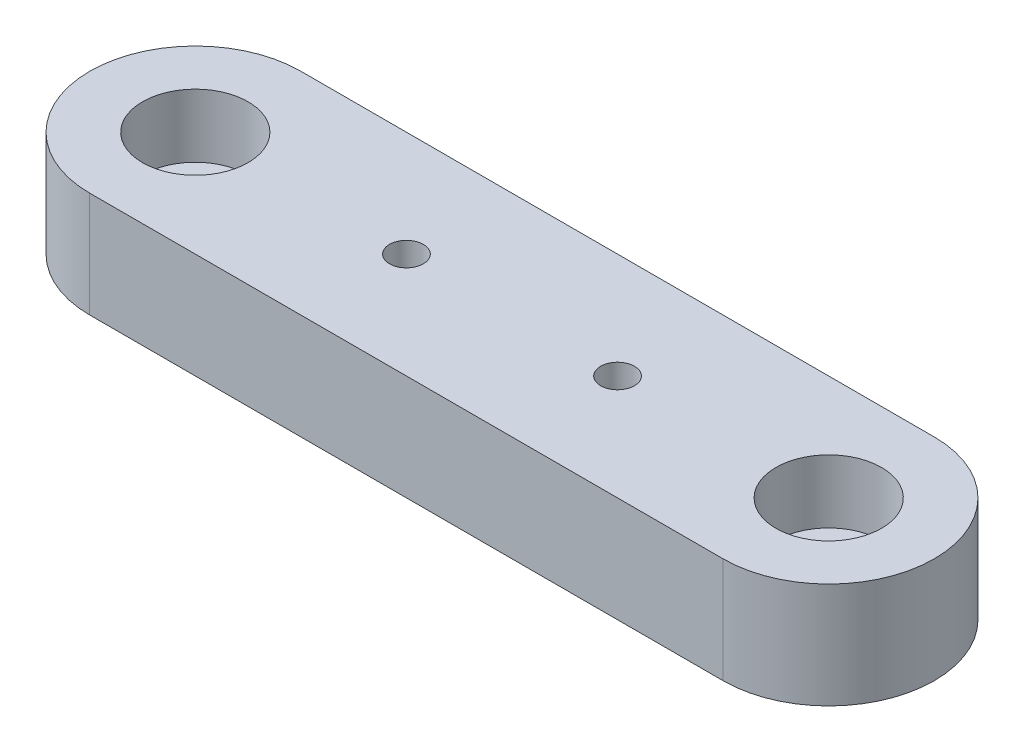
ISO-10303-21;
HEADER;
FILE_DESCRIPTION(('STEP AP214'),'2;1');
FILE_NAME('part.step','',(''),(''),'','','');
FILE_SCHEMA(('AUTOMOTIVE_DESIGN { 1 0 10303 214 1 1 1 1 }'));
ENDSEC;
DATA;
#1=APPLICATION_CONTEXT('core data for automotive mechanical design processes');
#2=APPLICATION_PROTOCOL_DEFINITION('international standard','automotive_design',2000,#1);
#3=PRODUCT_CONTEXT('',#1,'mechanical');
#4=PRODUCT('Part','Part','',(#3));
#5=PRODUCT_RELATED_PRODUCT_CATEGORY('part','',(#4));
#6=PRODUCT_DEFINITION_FORMATION('','',#4);
#7=PRODUCT_DEFINITION_CONTEXT('part definition',#1,'design');
#8=PRODUCT_DEFINITION('design','',#6,#7);
#9=PRODUCT_DEFINITION_SHAPE('','',#8);
#10=(LENGTH_UNIT() NAMED_UNIT(*) SI_UNIT(.MILLI.,.METRE.));
#11=(NAMED_UNIT(*) PLANE_ANGLE_UNIT() SI_UNIT($,.RADIAN.));
#12=(NAMED_UNIT(*) SI_UNIT($,.STERADIAN.) SOLID_ANGLE_UNIT());
#13=UNCERTAINTY_MEASURE_WITH_UNIT(LENGTH_MEASURE(1.E-05),#10,'distance_accuracy_value','');
#14=(GEOMETRIC_REPRESENTATION_CONTEXT(3) GLOBAL_UNCERTAINTY_ASSIGNED_CONTEXT((#13)) GLOBAL_UNIT_ASSIGNED_CONTEXT((#10,
#11,#12)) REPRESENTATION_CONTEXT('',''));
#15=CARTESIAN_POINT('',(0.,0.,0.));
#16=DIRECTION('',(0.,0.,1.));
#17=DIRECTION('',(1.,0.,0.));
#18=AXIS2_PLACEMENT_3D('',#15,#16,#17);
#19=CARTESIAN_POINT('',(0.,0.,0.));
#20=DIRECTION('',(0.,1.,0.));
#21=DIRECTION('',(0.,0.,1.));
#22=AXIS2_PLACEMENT_3D('',#19,#20,#21);
#23=PLANE('',#22);
#24=CARTESIAN_POINT('',(30.,0.,0.));
#25=DIRECTION('',(0.,1.,0.));
#26=DIRECTION('',(0.,0.,1.));
#27=AXIS2_PLACEMENT_3D('',#24,#25,#26);
#28=CIRCLE('',#27,3.);
#29=CARTESIAN_POINT('',(30.,0.,2.99999999999999));
#30=VERTEX_POINT('',#29);
#31=EDGE_CURVE('E149',#30,#30,#28,.F.);
#32=ORIENTED_EDGE('',*,*,#31,.F.);
#33=EDGE_LOOP('',(#32));
#34=FACE_BOUND('',#33,.T.);
#35=CARTESIAN_POINT('',(-30.,0.,0.));
#36=DIRECTION('',(0.,1.,0.));
#37=DIRECTION('',(0.,0.,1.));
#38=AXIS2_PLACEMENT_3D('',#35,#36,#37);
#39=CIRCLE('',#38,10.);
#40=CARTESIAN_POINT('',(-30.,0.,-10.));
#41=VERTEX_POINT('',#40);
#42=CARTESIAN_POINT('',(-30.,0.,10.));
#43=VERTEX_POINT('',#42);
#44=EDGE_CURVE('E136',#41,#43,#39,.T.);
#45=ORIENTED_EDGE('',*,*,#44,.F.);
#46=DIRECTION('',(1.,0.,0.));
#47=VECTOR('',#46,1.);
#48=CARTESIAN_POINT('',(0.,0.,-10.));
#49=LINE('',#48,#47);
#50=CARTESIAN_POINT('',(30.,0.,-9.99999999999999));
#51=VERTEX_POINT('',#50);
#52=EDGE_CURVE('E145',#41,#51,#49,.T.);
#53=ORIENTED_EDGE('',*,*,#52,.T.);
#54=CARTESIAN_POINT('',(30.,0.,0.));
#55=DIRECTION('',(0.,1.,0.));
#56=DIRECTION('',(0.,0.,1.));
#57=AXIS2_PLACEMENT_3D('',#54,#55,#56);
#58=CIRCLE('',#57,9.99999999999998);
#59=CARTESIAN_POINT('',(30.,0.,9.99999999999999));
#60=VERTEX_POINT('',#59);
#61=EDGE_CURVE('E142',#51,#60,#58,.F.);
#62=ORIENTED_EDGE('',*,*,#61,.T.);
#63=DIRECTION('',(1.,0.,0.));
#64=VECTOR('',#63,1.);
#65=CARTESIAN_POINT('',(0.,0.,10.));
#66=LINE('',#65,#64);
#67=EDGE_CURVE('E110',#43,#60,#66,.T.);
#68=ORIENTED_EDGE('',*,*,#67,.F.);
#69=EDGE_LOOP('',(#45,#53,#62,#68));
#70=FACE_BOUND('',#69,.T.);
#71=CARTESIAN_POINT('',(-30.,0.,0.));
#72=DIRECTION('',(0.,1.,0.));
#73=DIRECTION('',(0.,0.,1.));
#74=AXIS2_PLACEMENT_3D('',#71,#72,#73);
#75=CIRCLE('',#74,3.);
#76=CARTESIAN_POINT('',(-30.,0.,3.));
#77=VERTEX_POINT('',#76);
#78=EDGE_CURVE('E132',#77,#77,#75,.T.);
#79=ORIENTED_EDGE('',*,*,#78,.T.);
#80=EDGE_LOOP('',(#79));
#81=FACE_BOUND('',#80,.T.);
#82=CARTESIAN_POINT('',(10.,0.,0.));
#83=DIRECTION('',(0.,-1.,0.));
#84=DIRECTION('',(0.,0.,-1.));
#85=AXIS2_PLACEMENT_3D('',#82,#83,#84);
#86=CIRCLE('',#85,3.);
#87=CARTESIAN_POINT('',(10.,0.,-3.));
#88=VERTEX_POINT('',#87);
#89=EDGE_CURVE('E177',#88,#88,#86,.T.);
#90=ORIENTED_EDGE('',*,*,#89,.F.);
#91=EDGE_LOOP('',(#90));
#92=FACE_BOUND('',#91,.T.);
#93=CARTESIAN_POINT('',(-10.,0.,0.));
#94=DIRECTION('',(0.,-1.,0.));
#95=DIRECTION('',(0.,0.,-1.));
#96=AXIS2_PLACEMENT_3D('',#93,#94,#95);
#97=CIRCLE('',#96,3.);
#98=CARTESIAN_POINT('',(-10.,0.,-3.));
#99=VERTEX_POINT('',#98);
#100=EDGE_CURVE('E199',#99,#99,#97,.T.);
#101=ORIENTED_EDGE('',*,*,#100,.F.);
#102=EDGE_LOOP('',(#101));
#103=FACE_BOUND('',#102,.T.);
#104=ADVANCED_FACE('F42',(#34,#70,#81,#92,#103),#23,.F.);
#105=CARTESIAN_POINT('',(-30.,10.,0.));
#106=DIRECTION('',(0.,-1.,0.));
#107=DIRECTION('',(0.,0.,-1.));
#108=AXIS2_PLACEMENT_3D('',#105,#106,#107);
#109=CYLINDRICAL_SURFACE('',#108,3.);
#110=ORIENTED_EDGE('',*,*,#78,.F.);
#111=EDGE_LOOP('',(#110));
#112=FACE_BOUND('',#111,.T.);
#113=CARTESIAN_POINT('',(-30.,4.,0.));
#114=DIRECTION('',(0.,1.,0.));
#115=DIRECTION('',(0.,0.,1.));
#116=AXIS2_PLACEMENT_3D('',#113,#114,#115);
#117=CIRCLE('',#116,3.);
#118=CARTESIAN_POINT('',(-30.,4.,3.));
#119=VERTEX_POINT('',#118);
#120=EDGE_CURVE('E137',#119,#119,#117,.T.);
#121=ORIENTED_EDGE('',*,*,#120,.T.);
#122=EDGE_LOOP('',(#121));
#123=FACE_BOUND('',#122,.T.);
#124=ADVANCED_FACE('F44',(#112,#123),#109,.F.);
#125=CARTESIAN_POINT('',(-30.,10.,0.));
#126=DIRECTION('',(0.,-1.,0.));
#127=DIRECTION('',(0.,0.,-1.));
#128=AXIS2_PLACEMENT_3D('',#125,#126,#127);
#129=CYLINDRICAL_SURFACE('',#128,10.);
#130=ORIENTED_EDGE('',*,*,#44,.T.);
#131=DIRECTION('',(0.,-1.,0.));
#132=VECTOR('',#131,1.);
#133=CARTESIAN_POINT('',(-30.,10.,10.));
#134=LINE('',#133,#132);
#135=CARTESIAN_POINT('',(-30.,10.,10.));
#136=VERTEX_POINT('',#135);
#137=EDGE_CURVE('E11',#136,#43,#134,.T.);
#138=ORIENTED_EDGE('',*,*,#137,.F.);
#139=CARTESIAN_POINT('',(-30.,10.,0.));
#140=DIRECTION('',(0.,1.,0.));
#141=DIRECTION('',(0.,0.,1.));
#142=AXIS2_PLACEMENT_3D('',#139,#140,#141);
#143=CIRCLE('',#142,10.);
#144=CARTESIAN_POINT('',(-30.,10.,-10.));
#145=VERTEX_POINT('',#144);
#146=EDGE_CURVE('E104',#145,#136,#143,.T.);
#147=ORIENTED_EDGE('',*,*,#146,.F.);
#148=DIRECTION('',(0.,-1.,0.));
#149=VECTOR('',#148,1.);
#150=CARTESIAN_POINT('',(-30.,10.,-10.));
#151=LINE('',#150,#149);
#152=EDGE_CURVE('E64',#145,#41,#151,.T.);
#153=ORIENTED_EDGE('',*,*,#152,.T.);
#154=EDGE_LOOP('',(#130,#138,#147,#153));
#155=FACE_BOUND('',#154,.T.);
#156=ADVANCED_FACE('F214',(#155),#129,.T.);
#157=CARTESIAN_POINT('',(0.,10.,10.));
#158=DIRECTION('',(0.,0.,-1.));
#159=DIRECTION('',(-1.,0.,0.));
#160=AXIS2_PLACEMENT_3D('',#157,#158,#159);
#161=PLANE('',#160);
#162=ORIENTED_EDGE('',*,*,#67,.T.);
#163=DIRECTION('',(0.,-1.,0.));
#164=VECTOR('',#163,1.);
#165=CARTESIAN_POINT('',(30.,10.,9.99999999999999));
#166=LINE('',#165,#164);
#167=CARTESIAN_POINT('',(30.,10.,9.99999999999999));
#168=VERTEX_POINT('',#167);
#169=EDGE_CURVE('E53',#168,#60,#166,.T.);
#170=ORIENTED_EDGE('',*,*,#169,.F.);
#171=DIRECTION('',(1.,0.,0.));
#172=VECTOR('',#171,1.);
#173=CARTESIAN_POINT('',(0.,10.,10.));
#174=LINE('',#173,#172);
#175=EDGE_CURVE('E95',#136,#168,#174,.T.);
#176=ORIENTED_EDGE('',*,*,#175,.F.);
#177=ORIENTED_EDGE('',*,*,#137,.T.);
#178=EDGE_LOOP('',(#162,#170,#176,#177));
#179=FACE_BOUND('',#178,.T.);
#180=ADVANCED_FACE('F109',(#179),#161,.F.);
#181=CARTESIAN_POINT('',(30.,10.,0.));
#182=DIRECTION('',(0.,-1.,0.));
#183=DIRECTION('',(0.,0.,-1.));
#184=AXIS2_PLACEMENT_3D('',#181,#182,#183);
#185=CYLINDRICAL_SURFACE('',#184,9.99999999999998);
#186=ORIENTED_EDGE('',*,*,#61,.F.);
#187=DIRECTION('',(0.,-1.,0.));
#188=VECTOR('',#187,1.);
#189=CARTESIAN_POINT('',(30.,10.,-9.99999999999999));
#190=LINE('',#189,#188);
#191=CARTESIAN_POINT('',(30.,10.,-9.99999999999999));
#192=VERTEX_POINT('',#191);
#193=EDGE_CURVE('E83',#192,#51,#190,.T.);
#194=ORIENTED_EDGE('',*,*,#193,.F.);
#195=CARTESIAN_POINT('',(30.,10.,0.));
#196=DIRECTION('',(0.,1.,0.));
#197=DIRECTION('',(0.,0.,1.));
#198=AXIS2_PLACEMENT_3D('',#195,#196,#197);
#199=CIRCLE('',#198,9.99999999999998);
#200=EDGE_CURVE('E103',#192,#168,#199,.F.);
#201=ORIENTED_EDGE('',*,*,#200,.T.);
#202=ORIENTED_EDGE('',*,*,#169,.T.);
#203=EDGE_LOOP('',(#186,#194,#201,#202));
#204=FACE_BOUND('',#203,.T.);
#205=ADVANCED_FACE('F115',(#204),#185,.T.);
#206=CARTESIAN_POINT('',(10.,10.,0.));
#207=DIRECTION('',(0.,-1.,0.));
#208=DIRECTION('',(0.,0.,-1.));
#209=AXIS2_PLACEMENT_3D('',#206,#207,#208);
#210=CYLINDRICAL_SURFACE('',#209,1.6);
#211=CARTESIAN_POINT('',(10.,1.69999999999999,0.));
#212=DIRECTION('',(0.,-1.,0.));
#213=DIRECTION('',(0.,0.,-1.));
#214=AXIS2_PLACEMENT_3D('',#211,#212,#213);
#215=CIRCLE('',#214,1.6);
#216=CARTESIAN_POINT('',(10.,1.69999999999999,-1.6));
#217=VERTEX_POINT('',#216);
#218=EDGE_CURVE('E164',#217,#217,#215,.T.);
#219=ORIENTED_EDGE('',*,*,#218,.T.);
#220=EDGE_LOOP('',(#219));
#221=FACE_BOUND('',#220,.T.);
#222=CARTESIAN_POINT('',(10.,10.,0.));
#223=DIRECTION('',(0.,1.,0.));
#224=DIRECTION('',(0.,0.,1.));
#225=AXIS2_PLACEMENT_3D('',#222,#223,#224);
#226=CIRCLE('',#225,1.6);
#227=CARTESIAN_POINT('',(10.,10.,1.6));
#228=VERTEX_POINT('',#227);
#229=EDGE_CURVE('E128',#228,#228,#226,.F.);
#230=ORIENTED_EDGE('',*,*,#229,.F.);
#231=EDGE_LOOP('',(#230));
#232=FACE_BOUND('',#231,.T.);
#233=ADVANCED_FACE('F226',(#221,#232),#210,.F.);
#234=CARTESIAN_POINT('',(-10.,10.,0.));
#235=DIRECTION('',(0.,-1.,0.));
#236=DIRECTION('',(0.,0.,-1.));
#237=AXIS2_PLACEMENT_3D('',#234,#235,#236);
#238=CYLINDRICAL_SURFACE('',#237,1.6);
#239=CARTESIAN_POINT('',(-10.,1.69999999999999,0.));
#240=DIRECTION('',(0.,-1.,0.));
#241=DIRECTION('',(0.,0.,-1.));
#242=AXIS2_PLACEMENT_3D('',#239,#240,#241);
#243=CIRCLE('',#242,1.6);
#244=CARTESIAN_POINT('',(-10.,1.69999999999999,-1.6));
#245=VERTEX_POINT('',#244);
#246=EDGE_CURVE('E46',#245,#245,#243,.F.);
#247=ORIENTED_EDGE('',*,*,#246,.F.);
#248=EDGE_LOOP('',(#247));
#249=FACE_BOUND('',#248,.T.);
#250=CARTESIAN_POINT('',(-10.,10.,0.));
#251=DIRECTION('',(0.,1.,0.));
#252=DIRECTION('',(0.,0.,1.));
#253=AXIS2_PLACEMENT_3D('',#250,#251,#252);
#254=CIRCLE('',#253,1.6);
#255=CARTESIAN_POINT('',(-10.,10.,1.6));
#256=VERTEX_POINT('',#255);
#257=EDGE_CURVE('E121',#256,#256,#254,.T.);
#258=ORIENTED_EDGE('',*,*,#257,.T.);
#259=EDGE_LOOP('',(#258));
#260=FACE_BOUND('',#259,.T.);
#261=ADVANCED_FACE('F229',(#249,#260),#238,.F.);
#262=CARTESIAN_POINT('',(0.,10.,-10.));
#263=DIRECTION('',(0.,0.,-1.));
#264=DIRECTION('',(-1.,0.,0.));
#265=AXIS2_PLACEMENT_3D('',#262,#263,#264);
#266=PLANE('',#265);
#267=ORIENTED_EDGE('',*,*,#52,.F.);
#268=ORIENTED_EDGE('',*,*,#152,.F.);
#269=DIRECTION('',(1.,0.,0.));
#270=VECTOR('',#269,1.);
#271=CARTESIAN_POINT('',(0.,10.,-10.));
#272=LINE('',#271,#270);
#273=EDGE_CURVE('E117',#145,#192,#272,.T.);
#274=ORIENTED_EDGE('',*,*,#273,.T.);
#275=ORIENTED_EDGE('',*,*,#193,.T.);
#276=EDGE_LOOP('',(#267,#268,#274,#275));
#277=FACE_BOUND('',#276,.T.);
#278=ADVANCED_FACE('F224',(#277),#266,.T.);
#279=CARTESIAN_POINT('',(30.,10.,0.));
#280=DIRECTION('',(0.,-1.,0.));
#281=DIRECTION('',(0.,0.,-1.));
#282=AXIS2_PLACEMENT_3D('',#279,#280,#281);
#283=CYLINDRICAL_SURFACE('',#282,3.);
#284=CARTESIAN_POINT('',(30.,4.,0.));
#285=DIRECTION('',(0.,-1.,0.));
#286=DIRECTION('',(0.,0.,-1.));
#287=AXIS2_PLACEMENT_3D('',#284,#285,#286);
#288=CIRCLE('',#287,3.);
#289=CARTESIAN_POINT('',(30.,4.,-3.00000000000001));
#290=VERTEX_POINT('',#289);
#291=EDGE_CURVE('E157',#290,#290,#288,.F.);
#292=ORIENTED_EDGE('',*,*,#291,.T.);
#293=EDGE_LOOP('',(#292));
#294=FACE_BOUND('',#293,.T.);
#295=ORIENTED_EDGE('',*,*,#31,.T.);
#296=EDGE_LOOP('',(#295));
#297=FACE_BOUND('',#296,.T.);
#298=ADVANCED_FACE('F221',(#294,#297),#283,.F.);
#299=CARTESIAN_POINT('',(0.,10.,0.));
#300=DIRECTION('',(0.,1.,0.));
#301=DIRECTION('',(0.,0.,1.));
#302=AXIS2_PLACEMENT_3D('',#299,#300,#301);
#303=PLANE('',#302);
#304=CARTESIAN_POINT('',(-30.,10.,0.));
#305=DIRECTION('',(0.,1.,0.));
#306=DIRECTION('',(0.,0.,1.));
#307=AXIS2_PLACEMENT_3D('',#304,#305,#306);
#308=CIRCLE('',#307,5.);
#309=CARTESIAN_POINT('',(-30.,10.,5.));
#310=VERTEX_POINT('',#309);
#311=EDGE_CURVE('E189',#310,#310,#308,.T.);
#312=ORIENTED_EDGE('',*,*,#311,.F.);
#313=EDGE_LOOP('',(#312));
#314=FACE_BOUND('',#313,.T.);
#315=CARTESIAN_POINT('',(30.,10.,0.));
#316=DIRECTION('',(0.,1.,0.));
#317=DIRECTION('',(0.,0.,-1.));
#318=AXIS2_PLACEMENT_3D('',#315,#316,#317);
#319=CIRCLE('',#318,4.99999999999999);
#320=CARTESIAN_POINT('',(30.,10.,-5.));
#321=VERTEX_POINT('',#320);
#322=EDGE_CURVE('E167',#321,#321,#319,.T.);
#323=ORIENTED_EDGE('',*,*,#322,.F.);
#324=EDGE_LOOP('',(#323));
#325=FACE_BOUND('',#324,.T.);
#326=ORIENTED_EDGE('',*,*,#146,.T.);
#327=ORIENTED_EDGE('',*,*,#175,.T.);
#328=ORIENTED_EDGE('',*,*,#200,.F.);
#329=ORIENTED_EDGE('',*,*,#273,.F.);
#330=EDGE_LOOP('',(#326,#327,#328,#329));
#331=FACE_BOUND('',#330,.T.);
#332=ORIENTED_EDGE('',*,*,#257,.F.);
#333=EDGE_LOOP('',(#332));
#334=FACE_BOUND('',#333,.T.);
#335=ORIENTED_EDGE('',*,*,#229,.T.);
#336=EDGE_LOOP('',(#335));
#337=FACE_BOUND('',#336,.T.);
#338=ADVANCED_FACE('F99',(#314,#325,#331,#334,#337),#303,.T.);
#339=CARTESIAN_POINT('',(30.,4.,0.));
#340=DIRECTION('',(0.,-1.,0.));
#341=DIRECTION('',(0.,0.,-1.));
#342=AXIS2_PLACEMENT_3D('',#339,#340,#341);
#343=PLANE('',#342);
#344=CARTESIAN_POINT('',(30.,4.,0.));
#345=DIRECTION('',(0.,1.,0.));
#346=DIRECTION('',(0.,0.,-1.));
#347=AXIS2_PLACEMENT_3D('',#344,#345,#346);
#348=CIRCLE('',#347,4.99999999999999);
#349=CARTESIAN_POINT('',(30.,4.,-5.));
#350=VERTEX_POINT('',#349);
#351=EDGE_CURVE('E174',#350,#350,#348,.T.);
#352=ORIENTED_EDGE('',*,*,#351,.T.);
#353=EDGE_LOOP('',(#352));
#354=FACE_BOUND('',#353,.T.);
#355=ORIENTED_EDGE('',*,*,#291,.F.);
#356=EDGE_LOOP('',(#355));
#357=FACE_BOUND('',#356,.T.);
#358=ADVANCED_FACE('F270',(#354,#357),#343,.F.);
#359=CARTESIAN_POINT('',(30.,4.,0.));
#360=DIRECTION('',(0.,1.,0.));
#361=DIRECTION('',(0.,0.,1.));
#362=AXIS2_PLACEMENT_3D('',#359,#360,#361);
#363=CYLINDRICAL_SURFACE('',#362,4.99999999999999);
#364=ORIENTED_EDGE('',*,*,#351,.F.);
#365=EDGE_LOOP('',(#364));
#366=FACE_BOUND('',#365,.T.);
#367=ORIENTED_EDGE('',*,*,#322,.T.);
#368=EDGE_LOOP('',(#367));
#369=FACE_BOUND('',#368,.T.);
#370=ADVANCED_FACE('F268',(#366,#369),#363,.F.);
#371=CARTESIAN_POINT('',(-30.,4.,0.));
#372=DIRECTION('',(0.,1.,0.));
#373=DIRECTION('',(0.,0.,1.));
#374=AXIS2_PLACEMENT_3D('',#371,#372,#373);
#375=CYLINDRICAL_SURFACE('',#374,5.);
#376=CARTESIAN_POINT('',(-30.,4.,0.));
#377=DIRECTION('',(0.,1.,0.));
#378=DIRECTION('',(0.,0.,1.));
#379=AXIS2_PLACEMENT_3D('',#376,#377,#378);
#380=CIRCLE('',#379,5.);
#381=CARTESIAN_POINT('',(-30.,4.,5.));
#382=VERTEX_POINT('',#381);
#383=EDGE_CURVE('E161',#382,#382,#380,.T.);
#384=ORIENTED_EDGE('',*,*,#383,.F.);
#385=EDGE_LOOP('',(#384));
#386=FACE_BOUND('',#385,.T.);
#387=ORIENTED_EDGE('',*,*,#311,.T.);
#388=EDGE_LOOP('',(#387));
#389=FACE_BOUND('',#388,.T.);
#390=ADVANCED_FACE('F264',(#386,#389),#375,.F.);
#391=CARTESIAN_POINT('',(-30.,4.,0.));
#392=DIRECTION('',(0.,1.,0.));
#393=DIRECTION('',(0.,0.,1.));
#394=AXIS2_PLACEMENT_3D('',#391,#392,#393);
#395=PLANE('',#394);
#396=ORIENTED_EDGE('',*,*,#120,.F.);
#397=EDGE_LOOP('',(#396));
#398=FACE_BOUND('',#397,.T.);
#399=ORIENTED_EDGE('',*,*,#383,.T.);
#400=EDGE_LOOP('',(#399));
#401=FACE_BOUND('',#400,.T.);
#402=ADVANCED_FACE('F258',(#398,#401),#395,.T.);
#403=CARTESIAN_POINT('',(10.,0.299999999999996,0.));
#404=DIRECTION('',(0.,-1.,0.));
#405=DIRECTION('',(0.,0.,-1.));
#406=AXIS2_PLACEMENT_3D('',#403,#404,#405);
#407=CONICAL_SURFACE('',#406,3.,0.785398163397449);
#408=CARTESIAN_POINT('',(10.,0.299999999999996,0.));
#409=DIRECTION('',(0.,-1.,0.));
#410=DIRECTION('',(0.,0.,-1.));
#411=AXIS2_PLACEMENT_3D('',#408,#409,#410);
#412=CIRCLE('',#411,3.);
#413=CARTESIAN_POINT('',(10.,0.299999999999996,-3.));
#414=VERTEX_POINT('',#413);
#415=EDGE_CURVE('E168',#414,#414,#412,.T.);
#416=ORIENTED_EDGE('',*,*,#415,.T.);
#417=EDGE_LOOP('',(#416));
#418=FACE_BOUND('',#417,.T.);
#419=ORIENTED_EDGE('',*,*,#218,.F.);
#420=EDGE_LOOP('',(#419));
#421=FACE_BOUND('',#420,.T.);
#422=ADVANCED_FACE('F249',(#418,#421),#407,.F.);
#423=CARTESIAN_POINT('',(10.,0.,0.));
#424=DIRECTION('',(0.,-1.,0.));
#425=DIRECTION('',(0.,0.,-1.));
#426=AXIS2_PLACEMENT_3D('',#423,#424,#425);
#427=CYLINDRICAL_SURFACE('',#426,3.);
#428=ORIENTED_EDGE('',*,*,#415,.F.);
#429=EDGE_LOOP('',(#428));
#430=FACE_BOUND('',#429,.T.);
#431=ORIENTED_EDGE('',*,*,#89,.T.);
#432=EDGE_LOOP('',(#431));
#433=FACE_BOUND('',#432,.T.);
#434=ADVANCED_FACE('F246',(#430,#433),#427,.F.);
#435=CARTESIAN_POINT('',(-10.,0.299999999999996,0.));
#436=DIRECTION('',(0.,-1.,0.));
#437=DIRECTION('',(0.,0.,-1.));
#438=AXIS2_PLACEMENT_3D('',#435,#436,#437);
#439=CONICAL_SURFACE('',#438,3.,0.785398163397449);
#440=ORIENTED_EDGE('',*,*,#246,.T.);
#441=EDGE_LOOP('',(#440));
#442=FACE_BOUND('',#441,.T.);
#443=CARTESIAN_POINT('',(-10.,0.299999999999996,0.));
#444=DIRECTION('',(0.,-1.,0.));
#445=DIRECTION('',(0.,0.,-1.));
#446=AXIS2_PLACEMENT_3D('',#443,#444,#445);
#447=CIRCLE('',#446,3.);
#448=CARTESIAN_POINT('',(-10.,0.299999999999996,-3.));
#449=VERTEX_POINT('',#448);
#450=EDGE_CURVE('E196',#449,#449,#447,.T.);
#451=ORIENTED_EDGE('',*,*,#450,.T.);
#452=EDGE_LOOP('',(#451));
#453=FACE_BOUND('',#452,.T.);
#454=ADVANCED_FACE('F248',(#442,#453),#439,.F.);
#455=CARTESIAN_POINT('',(-10.,0.,0.));
#456=DIRECTION('',(0.,-1.,0.));
#457=DIRECTION('',(0.,0.,-1.));
#458=AXIS2_PLACEMENT_3D('',#455,#456,#457);
#459=CYLINDRICAL_SURFACE('',#458,3.);
#460=ORIENTED_EDGE('',*,*,#450,.F.);
#461=EDGE_LOOP('',(#460));
#462=FACE_BOUND('',#461,.T.);
#463=ORIENTED_EDGE('',*,*,#100,.T.);
#464=EDGE_LOOP('',(#463));
#465=FACE_BOUND('',#464,.T.);
#466=ADVANCED_FACE('F206',(#462,#465),#459,.F.);
#467=CLOSED_SHELL('',(#104,#124,#156,#180,#205,#233,#261,#278,#298,#338,#358,#370,#390,#402,
#422,#434,#454,#466));
#468=MANIFOLD_SOLID_BREP('B2',#467);
#469=ADVANCED_BREP_SHAPE_REPRESENTATION('',(#18,#468),#14);
#470=SHAPE_DEFINITION_REPRESENTATION(#9,#469);
ENDSEC;
END-ISO-10303-21;
